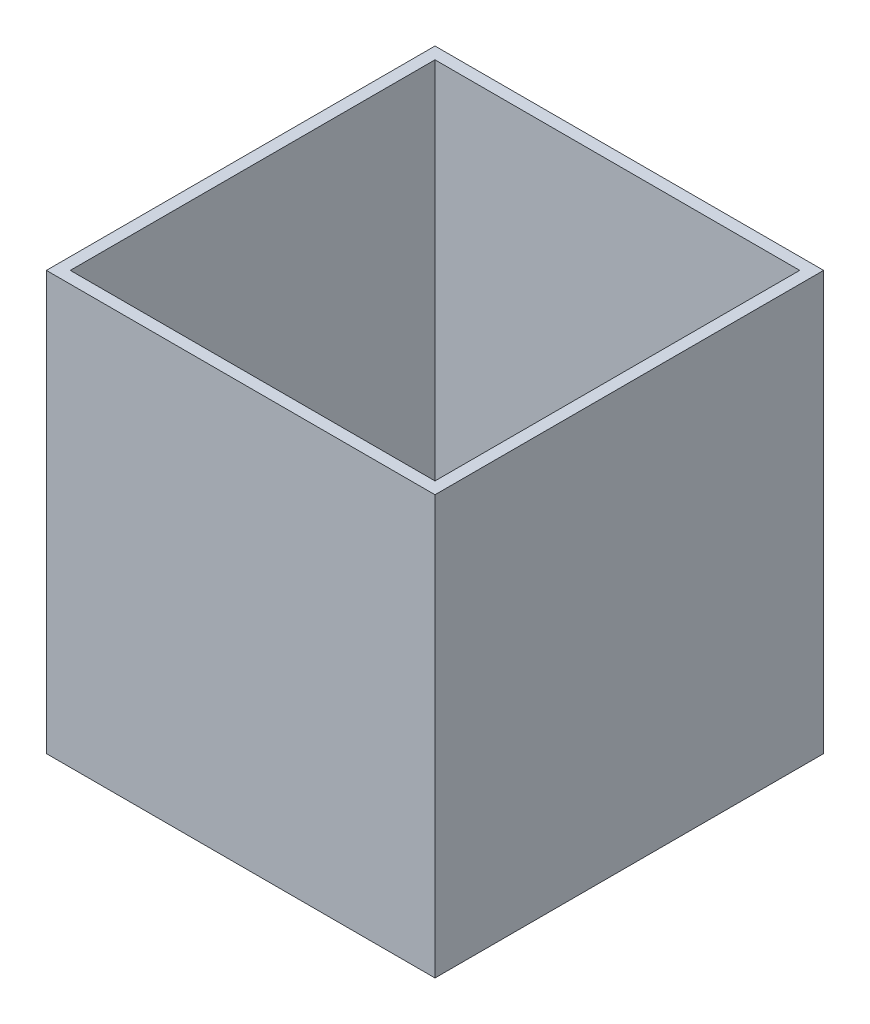
ISO-10303-21;
HEADER;
FILE_DESCRIPTION(('STEP AP214'),'2;1');
FILE_NAME('part.step','',(''),(''),'','','');
FILE_SCHEMA(('AUTOMOTIVE_DESIGN { 1 0 10303 214 1 1 1 1 }'));
ENDSEC;
DATA;
#1=APPLICATION_CONTEXT('core data for automotive mechanical design processes');
#2=APPLICATION_PROTOCOL_DEFINITION('international standard','automotive_design',2000,#1);
#3=PRODUCT_CONTEXT('',#1,'mechanical');
#4=PRODUCT('Part','Part','',(#3));
#5=PRODUCT_RELATED_PRODUCT_CATEGORY('part','',(#4));
#6=PRODUCT_DEFINITION_FORMATION('','',#4);
#7=PRODUCT_DEFINITION_CONTEXT('part definition',#1,'design');
#8=PRODUCT_DEFINITION('design','',#6,#7);
#9=PRODUCT_DEFINITION_SHAPE('','',#8);
#10=(LENGTH_UNIT() NAMED_UNIT(*) SI_UNIT(.MILLI.,.METRE.));
#11=(NAMED_UNIT(*) PLANE_ANGLE_UNIT() SI_UNIT($,.RADIAN.));
#12=(NAMED_UNIT(*) SI_UNIT($,.STERADIAN.) SOLID_ANGLE_UNIT());
#13=UNCERTAINTY_MEASURE_WITH_UNIT(LENGTH_MEASURE(1.E-05),#10,'distance_accuracy_value','');
#14=(GEOMETRIC_REPRESENTATION_CONTEXT(3) GLOBAL_UNCERTAINTY_ASSIGNED_CONTEXT((#13)) GLOBAL_UNIT_ASSIGNED_CONTEXT((#10,
#11,#12)) REPRESENTATION_CONTEXT('',''));
#15=CARTESIAN_POINT('',(0.,0.,0.));
#16=DIRECTION('',(0.,0.,1.));
#17=DIRECTION('',(1.,0.,0.));
#18=AXIS2_PLACEMENT_3D('',#15,#16,#17);
#19=CARTESIAN_POINT('',(0.,88.9,0.));
#20=DIRECTION('',(1.,0.,0.));
#21=DIRECTION('',(0.,0.,-1.));
#22=AXIS2_PLACEMENT_3D('',#19,#20,#21);
#23=PLANE('',#22);
#24=DIRECTION('',(0.,0.,1.));
#25=VECTOR('',#24,1.);
#26=CARTESIAN_POINT('',(0.,0.,0.));
#27=LINE('',#26,#25);
#28=CARTESIAN_POINT('',(0.,0.,0.));
#29=VERTEX_POINT('',#28);
#30=CARTESIAN_POINT('',(0.,0.,82.55));
#31=VERTEX_POINT('',#30);
#32=EDGE_CURVE('E148',#29,#31,#27,.T.);
#33=ORIENTED_EDGE('',*,*,#32,.T.);
#34=DIRECTION('',(0.,-1.,0.));
#35=VECTOR('',#34,1.);
#36=CARTESIAN_POINT('',(0.,88.9,82.55));
#37=LINE('',#36,#35);
#38=CARTESIAN_POINT('',(0.,88.9,82.55));
#39=VERTEX_POINT('',#38);
#40=EDGE_CURVE('E11',#39,#31,#37,.T.);
#41=ORIENTED_EDGE('',*,*,#40,.F.);
#42=DIRECTION('',(0.,0.,1.));
#43=VECTOR('',#42,1.);
#44=CARTESIAN_POINT('',(0.,88.9,0.));
#45=LINE('',#44,#43);
#46=CARTESIAN_POINT('',(0.,88.9,0.));
#47=VERTEX_POINT('',#46);
#48=EDGE_CURVE('E141',#47,#39,#45,.T.);
#49=ORIENTED_EDGE('',*,*,#48,.F.);
#50=DIRECTION('',(0.,-1.,0.));
#51=VECTOR('',#50,1.);
#52=CARTESIAN_POINT('',(0.,88.9,0.));
#53=LINE('',#52,#51);
#54=EDGE_CURVE('E147',#47,#29,#53,.T.);
#55=ORIENTED_EDGE('',*,*,#54,.T.);
#56=EDGE_LOOP('',(#33,#41,#49,#55));
#57=FACE_BOUND('',#56,.T.);
#58=ADVANCED_FACE('F34',(#57),#23,.F.);
#59=CARTESIAN_POINT('',(0.,88.9,82.55));
#60=DIRECTION('',(0.,0.,-1.));
#61=DIRECTION('',(-1.,0.,0.));
#62=AXIS2_PLACEMENT_3D('',#59,#60,#61);
#63=PLANE('',#62);
#64=DIRECTION('',(1.,0.,0.));
#65=VECTOR('',#64,1.);
#66=CARTESIAN_POINT('',(0.,0.,82.55));
#67=LINE('',#66,#65);
#68=CARTESIAN_POINT('',(82.55,0.,82.55));
#69=VERTEX_POINT('',#68);
#70=EDGE_CURVE('E151',#31,#69,#67,.T.);
#71=ORIENTED_EDGE('',*,*,#70,.T.);
#72=DIRECTION('',(0.,-1.,0.));
#73=VECTOR('',#72,1.);
#74=CARTESIAN_POINT('',(82.55,88.9,82.55));
#75=LINE('',#74,#73);
#76=CARTESIAN_POINT('',(82.55,88.9,82.55));
#77=VERTEX_POINT('',#76);
#78=EDGE_CURVE('E41',#77,#69,#75,.T.);
#79=ORIENTED_EDGE('',*,*,#78,.F.);
#80=DIRECTION('',(1.,0.,0.));
#81=VECTOR('',#80,1.);
#82=CARTESIAN_POINT('',(0.,88.9,82.55));
#83=LINE('',#82,#81);
#84=EDGE_CURVE('E85',#39,#77,#83,.T.);
#85=ORIENTED_EDGE('',*,*,#84,.F.);
#86=ORIENTED_EDGE('',*,*,#40,.T.);
#87=EDGE_LOOP('',(#71,#79,#85,#86));
#88=FACE_BOUND('',#87,.T.);
#89=ADVANCED_FACE('F180',(#88),#63,.F.);
#90=CARTESIAN_POINT('',(82.55,88.9,0.));
#91=DIRECTION('',(-1.,0.,0.));
#92=DIRECTION('',(0.,0.,1.));
#93=AXIS2_PLACEMENT_3D('',#90,#91,#92);
#94=PLANE('',#93);
#95=DIRECTION('',(0.,0.,-1.));
#96=VECTOR('',#95,1.);
#97=CARTESIAN_POINT('',(82.55,0.,0.));
#98=LINE('',#97,#96);
#99=CARTESIAN_POINT('',(82.55,0.,0.));
#100=VERTEX_POINT('',#99);
#101=EDGE_CURVE('E153',#69,#100,#98,.T.);
#102=ORIENTED_EDGE('',*,*,#101,.T.);
#103=DIRECTION('',(0.,-1.,0.));
#104=VECTOR('',#103,1.);
#105=CARTESIAN_POINT('',(82.55,88.9,0.));
#106=LINE('',#105,#104);
#107=CARTESIAN_POINT('',(82.55,88.9,0.));
#108=VERTEX_POINT('',#107);
#109=EDGE_CURVE('E157',#108,#100,#106,.T.);
#110=ORIENTED_EDGE('',*,*,#109,.F.);
#111=DIRECTION('',(0.,0.,-1.));
#112=VECTOR('',#111,1.);
#113=CARTESIAN_POINT('',(82.55,88.9,0.));
#114=LINE('',#113,#112);
#115=EDGE_CURVE('E144',#77,#108,#114,.T.);
#116=ORIENTED_EDGE('',*,*,#115,.F.);
#117=ORIENTED_EDGE('',*,*,#78,.T.);
#118=EDGE_LOOP('',(#102,#110,#116,#117));
#119=FACE_BOUND('',#118,.T.);
#120=ADVANCED_FACE('F162',(#119),#94,.F.);
#121=CARTESIAN_POINT('',(0.,88.9,0.));
#122=DIRECTION('',(0.,0.,1.));
#123=DIRECTION('',(1.,0.,0.));
#124=AXIS2_PLACEMENT_3D('',#121,#122,#123);
#125=PLANE('',#124);
#126=DIRECTION('',(-1.,0.,0.));
#127=VECTOR('',#126,1.);
#128=CARTESIAN_POINT('',(0.,0.,0.));
#129=LINE('',#128,#127);
#130=EDGE_CURVE('E78',#100,#29,#129,.T.);
#131=ORIENTED_EDGE('',*,*,#130,.T.);
#132=ORIENTED_EDGE('',*,*,#54,.F.);
#133=DIRECTION('',(-1.,0.,0.));
#134=VECTOR('',#133,1.);
#135=CARTESIAN_POINT('',(0.,88.9,0.));
#136=LINE('',#135,#134);
#137=EDGE_CURVE('E57',#108,#47,#136,.T.);
#138=ORIENTED_EDGE('',*,*,#137,.F.);
#139=ORIENTED_EDGE('',*,*,#109,.T.);
#140=EDGE_LOOP('',(#131,#132,#138,#139));
#141=FACE_BOUND('',#140,.T.);
#142=ADVANCED_FACE('F170',(#141),#125,.F.);
#143=CARTESIAN_POINT('',(0.,88.9,0.));
#144=DIRECTION('',(0.,1.,0.));
#145=DIRECTION('',(0.,0.,1.));
#146=AXIS2_PLACEMENT_3D('',#143,#144,#145);
#147=PLANE('',#146);
#148=DIRECTION('',(0.,0.,1.));
#149=VECTOR('',#148,1.);
#150=CARTESIAN_POINT('',(2.54,88.9,0.));
#151=LINE('',#150,#149);
#152=CARTESIAN_POINT('',(2.54,88.9,2.54));
#153=VERTEX_POINT('',#152);
#154=CARTESIAN_POINT('',(2.54000000000001,88.9,80.01));
#155=VERTEX_POINT('',#154);
#156=EDGE_CURVE('E130',#153,#155,#151,.T.);
#157=ORIENTED_EDGE('',*,*,#156,.F.);
#158=DIRECTION('',(-1.,0.,0.));
#159=VECTOR('',#158,1.);
#160=CARTESIAN_POINT('',(0.,88.9,2.54));
#161=LINE('',#160,#159);
#162=CARTESIAN_POINT('',(80.01,88.9,2.54));
#163=VERTEX_POINT('',#162);
#164=EDGE_CURVE('E139',#163,#153,#161,.T.);
#165=ORIENTED_EDGE('',*,*,#164,.F.);
#166=DIRECTION('',(0.,0.,-1.));
#167=VECTOR('',#166,1.);
#168=CARTESIAN_POINT('',(80.01,88.9,0.));
#169=LINE('',#168,#167);
#170=CARTESIAN_POINT('',(80.01,88.9,80.01));
#171=VERTEX_POINT('',#170);
#172=EDGE_CURVE('E137',#171,#163,#169,.T.);
#173=ORIENTED_EDGE('',*,*,#172,.F.);
#174=DIRECTION('',(1.,0.,0.));
#175=VECTOR('',#174,1.);
#176=CARTESIAN_POINT('',(0.,88.9,80.01));
#177=LINE('',#176,#175);
#178=EDGE_CURVE('E122',#155,#171,#177,.T.);
#179=ORIENTED_EDGE('',*,*,#178,.F.);
#180=EDGE_LOOP('',(#157,#165,#173,#179));
#181=FACE_BOUND('',#180,.T.);
#182=ORIENTED_EDGE('',*,*,#48,.T.);
#183=ORIENTED_EDGE('',*,*,#84,.T.);
#184=ORIENTED_EDGE('',*,*,#115,.T.);
#185=ORIENTED_EDGE('',*,*,#137,.T.);
#186=EDGE_LOOP('',(#182,#183,#184,#185));
#187=FACE_BOUND('',#186,.T.);
#188=ADVANCED_FACE('F172',(#181,#187),#147,.T.);
#189=CARTESIAN_POINT('',(0.,0.,0.));
#190=DIRECTION('',(0.,1.,0.));
#191=DIRECTION('',(0.,0.,1.));
#192=AXIS2_PLACEMENT_3D('',#189,#190,#191);
#193=PLANE('',#192);
#194=ORIENTED_EDGE('',*,*,#32,.F.);
#195=ORIENTED_EDGE('',*,*,#130,.F.);
#196=ORIENTED_EDGE('',*,*,#101,.F.);
#197=ORIENTED_EDGE('',*,*,#70,.F.);
#198=EDGE_LOOP('',(#194,#195,#196,#197));
#199=FACE_BOUND('',#198,.T.);
#200=ADVANCED_FACE('F166',(#199),#193,.F.);
#201=CARTESIAN_POINT('',(2.54,88.9,0.));
#202=DIRECTION('',(1.,0.,0.));
#203=DIRECTION('',(0.,0.,-1.));
#204=AXIS2_PLACEMENT_3D('',#201,#202,#203);
#205=PLANE('',#204);
#206=DIRECTION('',(0.,0.,1.));
#207=VECTOR('',#206,1.);
#208=CARTESIAN_POINT('',(2.54,2.54,0.));
#209=LINE('',#208,#207);
#210=CARTESIAN_POINT('',(2.54,2.54,2.54));
#211=VERTEX_POINT('',#210);
#212=CARTESIAN_POINT('',(2.54000000000001,2.54,80.01));
#213=VERTEX_POINT('',#212);
#214=EDGE_CURVE('E113',#211,#213,#209,.T.);
#215=ORIENTED_EDGE('',*,*,#214,.F.);
#216=DIRECTION('',(0.,-1.,0.));
#217=VECTOR('',#216,1.);
#218=CARTESIAN_POINT('',(2.54,88.9,2.54));
#219=LINE('',#218,#217);
#220=EDGE_CURVE('E133',#153,#211,#219,.T.);
#221=ORIENTED_EDGE('',*,*,#220,.F.);
#222=ORIENTED_EDGE('',*,*,#156,.T.);
#223=DIRECTION('',(0.,-1.,0.));
#224=VECTOR('',#223,1.);
#225=CARTESIAN_POINT('',(2.54000000000001,88.9,80.01));
#226=LINE('',#225,#224);
#227=EDGE_CURVE('E125',#155,#213,#226,.T.);
#228=ORIENTED_EDGE('',*,*,#227,.T.);
#229=EDGE_LOOP('',(#215,#221,#222,#228));
#230=FACE_BOUND('',#229,.T.);
#231=ADVANCED_FACE('F207',(#230),#205,.T.);
#232=CARTESIAN_POINT('',(0.,88.9,80.01));
#233=DIRECTION('',(0.,0.,-1.));
#234=DIRECTION('',(-1.,0.,0.));
#235=AXIS2_PLACEMENT_3D('',#232,#233,#234);
#236=PLANE('',#235);
#237=DIRECTION('',(1.,0.,0.));
#238=VECTOR('',#237,1.);
#239=CARTESIAN_POINT('',(0.,2.54,80.01));
#240=LINE('',#239,#238);
#241=CARTESIAN_POINT('',(80.01,2.54,80.01));
#242=VERTEX_POINT('',#241);
#243=EDGE_CURVE('E107',#213,#242,#240,.T.);
#244=ORIENTED_EDGE('',*,*,#243,.F.);
#245=ORIENTED_EDGE('',*,*,#227,.F.);
#246=ORIENTED_EDGE('',*,*,#178,.T.);
#247=DIRECTION('',(0.,-1.,0.));
#248=VECTOR('',#247,1.);
#249=CARTESIAN_POINT('',(80.01,88.9,80.01));
#250=LINE('',#249,#248);
#251=EDGE_CURVE('E119',#171,#242,#250,.T.);
#252=ORIENTED_EDGE('',*,*,#251,.T.);
#253=EDGE_LOOP('',(#244,#245,#246,#252));
#254=FACE_BOUND('',#253,.T.);
#255=ADVANCED_FACE('F120',(#254),#236,.T.);
#256=CARTESIAN_POINT('',(80.01,88.9,0.));
#257=DIRECTION('',(-1.,0.,0.));
#258=DIRECTION('',(0.,0.,1.));
#259=AXIS2_PLACEMENT_3D('',#256,#257,#258);
#260=PLANE('',#259);
#261=DIRECTION('',(0.,0.,-1.));
#262=VECTOR('',#261,1.);
#263=CARTESIAN_POINT('',(80.01,2.54,0.));
#264=LINE('',#263,#262);
#265=CARTESIAN_POINT('',(80.01,2.54,2.54));
#266=VERTEX_POINT('',#265);
#267=EDGE_CURVE('E111',#242,#266,#264,.T.);
#268=ORIENTED_EDGE('',*,*,#267,.F.);
#269=ORIENTED_EDGE('',*,*,#251,.F.);
#270=ORIENTED_EDGE('',*,*,#172,.T.);
#271=DIRECTION('',(0.,-1.,0.));
#272=VECTOR('',#271,1.);
#273=CARTESIAN_POINT('',(80.01,88.9,2.54));
#274=LINE('',#273,#272);
#275=EDGE_CURVE('E48',#163,#266,#274,.T.);
#276=ORIENTED_EDGE('',*,*,#275,.T.);
#277=EDGE_LOOP('',(#268,#269,#270,#276));
#278=FACE_BOUND('',#277,.T.);
#279=ADVANCED_FACE('F127',(#278),#260,.T.);
#280=CARTESIAN_POINT('',(0.,88.9,2.54));
#281=DIRECTION('',(0.,0.,1.));
#282=DIRECTION('',(1.,0.,0.));
#283=AXIS2_PLACEMENT_3D('',#280,#281,#282);
#284=PLANE('',#283);
#285=DIRECTION('',(-1.,0.,0.));
#286=VECTOR('',#285,1.);
#287=CARTESIAN_POINT('',(0.,2.54,2.54));
#288=LINE('',#287,#286);
#289=EDGE_CURVE('E128',#266,#211,#288,.T.);
#290=ORIENTED_EDGE('',*,*,#289,.F.);
#291=ORIENTED_EDGE('',*,*,#275,.F.);
#292=ORIENTED_EDGE('',*,*,#164,.T.);
#293=ORIENTED_EDGE('',*,*,#220,.T.);
#294=EDGE_LOOP('',(#290,#291,#292,#293));
#295=FACE_BOUND('',#294,.T.);
#296=ADVANCED_FACE('F237',(#295),#284,.T.);
#297=CARTESIAN_POINT('',(0.,2.54,0.));
#298=DIRECTION('',(0.,1.,0.));
#299=DIRECTION('',(0.,0.,1.));
#300=AXIS2_PLACEMENT_3D('',#297,#298,#299);
#301=PLANE('',#300);
#302=ORIENTED_EDGE('',*,*,#214,.T.);
#303=ORIENTED_EDGE('',*,*,#243,.T.);
#304=ORIENTED_EDGE('',*,*,#267,.T.);
#305=ORIENTED_EDGE('',*,*,#289,.T.);
#306=EDGE_LOOP('',(#302,#303,#304,#305));
#307=FACE_BOUND('',#306,.T.);
#308=ADVANCED_FACE('F109',(#307),#301,.T.);
#309=CLOSED_SHELL('',(#58,#89,#120,#142,#188,#200,#231,#255,#279,#296,#308));
#310=MANIFOLD_SOLID_BREP('B2',#309);
#311=ADVANCED_BREP_SHAPE_REPRESENTATION('',(#18,#310),#14);
#312=SHAPE_DEFINITION_REPRESENTATION(#9,#311);
ENDSEC;
END-ISO-10303-21;
